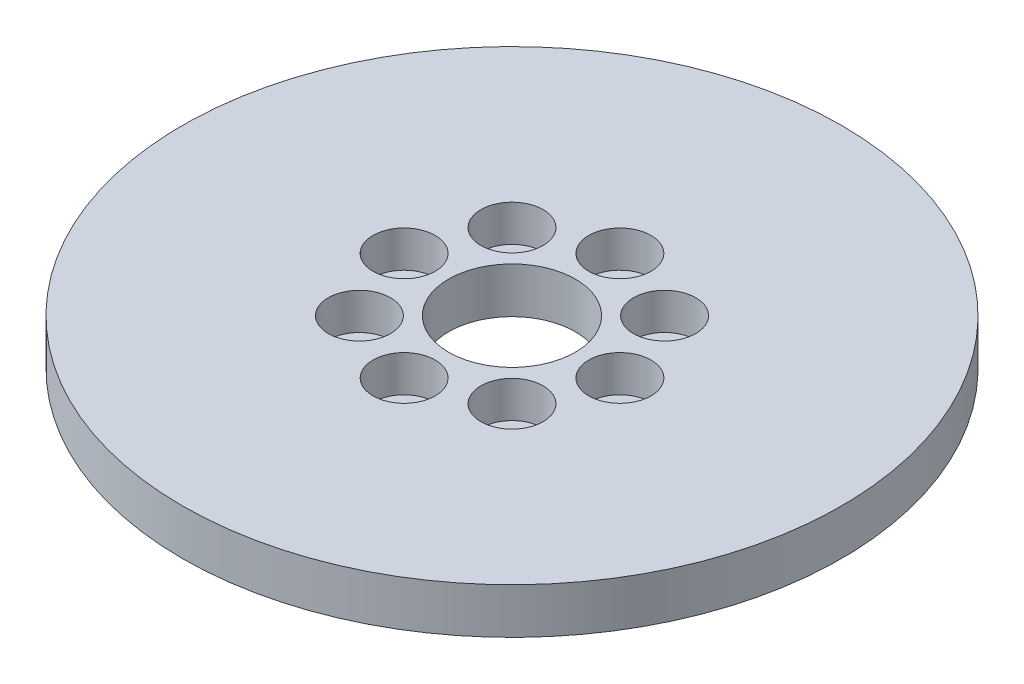
ISO-10303-21;
HEADER;
FILE_DESCRIPTION(('STEP AP214'),'2;1');
FILE_NAME('part.step','',(''),(''),'','','');
FILE_SCHEMA(('AUTOMOTIVE_DESIGN { 1 0 10303 214 1 1 1 1 }'));
ENDSEC;
DATA;
#1=APPLICATION_CONTEXT('core data for automotive mechanical design processes');
#2=APPLICATION_PROTOCOL_DEFINITION('international standard','automotive_design',2000,#1);
#3=PRODUCT_CONTEXT('',#1,'mechanical');
#4=PRODUCT('Part','Part','',(#3));
#5=PRODUCT_RELATED_PRODUCT_CATEGORY('part','',(#4));
#6=PRODUCT_DEFINITION_FORMATION('','',#4);
#7=PRODUCT_DEFINITION_CONTEXT('part definition',#1,'design');
#8=PRODUCT_DEFINITION('design','',#6,#7);
#9=PRODUCT_DEFINITION_SHAPE('','',#8);
#10=(LENGTH_UNIT() NAMED_UNIT(*) SI_UNIT(.MILLI.,.METRE.));
#11=(NAMED_UNIT(*) PLANE_ANGLE_UNIT() SI_UNIT($,.RADIAN.));
#12=(NAMED_UNIT(*) SI_UNIT($,.STERADIAN.) SOLID_ANGLE_UNIT());
#13=UNCERTAINTY_MEASURE_WITH_UNIT(LENGTH_MEASURE(1.E-05),#10,'distance_accuracy_value','');
#14=(GEOMETRIC_REPRESENTATION_CONTEXT(3) GLOBAL_UNCERTAINTY_ASSIGNED_CONTEXT((#13)) GLOBAL_UNIT_ASSIGNED_CONTEXT((#10,
#11,#12)) REPRESENTATION_CONTEXT('',''));
#15=CARTESIAN_POINT('',(0.,0.,0.));
#16=DIRECTION('',(0.,0.,1.));
#17=DIRECTION('',(1.,0.,0.));
#18=AXIS2_PLACEMENT_3D('',#15,#16,#17);
#19=CARTESIAN_POINT('',(0.,9.,0.));
#20=DIRECTION('',(0.,-1.,0.));
#21=DIRECTION('',(0.,0.,-1.));
#22=AXIS2_PLACEMENT_3D('',#19,#20,#21);
#23=CYLINDRICAL_SURFACE('',#22,65.);
#24=CARTESIAN_POINT('',(0.,9.,0.));
#25=DIRECTION('',(0.,1.,0.));
#26=DIRECTION('',(0.,0.,1.));
#27=AXIS2_PLACEMENT_3D('',#24,#25,#26);
#28=CIRCLE('',#27,65.);
#29=CARTESIAN_POINT('',(0.,9.,65.));
#30=VERTEX_POINT('',#29);
#31=EDGE_CURVE('E10',#30,#30,#28,.T.);
#32=ORIENTED_EDGE('',*,*,#31,.F.);
#33=EDGE_LOOP('',(#32));
#34=FACE_BOUND('',#33,.T.);
#35=CARTESIAN_POINT('',(0.,0.,0.));
#36=DIRECTION('',(0.,1.,0.));
#37=DIRECTION('',(0.,0.,1.));
#38=AXIS2_PLACEMENT_3D('',#35,#36,#37);
#39=CIRCLE('',#38,65.);
#40=CARTESIAN_POINT('',(0.,0.,65.));
#41=VERTEX_POINT('',#40);
#42=EDGE_CURVE('E37',#41,#41,#39,.T.);
#43=ORIENTED_EDGE('',*,*,#42,.T.);
#44=EDGE_LOOP('',(#43));
#45=FACE_BOUND('',#44,.T.);
#46=ADVANCED_FACE('F40',(#34,#45),#23,.T.);
#47=CARTESIAN_POINT('',(0.,9.,0.));
#48=DIRECTION('',(0.,1.,0.));
#49=DIRECTION('',(0.,0.,1.));
#50=AXIS2_PLACEMENT_3D('',#47,#48,#49);
#51=PLANE('',#50);
#52=CARTESIAN_POINT('',(0.,9.,21.2800590413485));
#53=DIRECTION('',(0.,1.,0.));
#54=DIRECTION('',(1.,0.,0.));
#55=AXIS2_PLACEMENT_3D('',#52,#53,#54);
#56=CIRCLE('',#55,6.13402978247689);
#57=CARTESIAN_POINT('',(6.13402978247697,9.,21.2800590413485));
#58=VERTEX_POINT('',#57);
#59=EDGE_CURVE('E88',#58,#58,#56,.T.);
#60=ORIENTED_EDGE('',*,*,#59,.F.);
#61=EDGE_LOOP('',(#60));
#62=FACE_BOUND('',#61,.T.);
#63=CARTESIAN_POINT('',(15.0472740521877,9.,15.0472740521875));
#64=DIRECTION('',(0.,1.,0.));
#65=DIRECTION('',(0.707106781186544,0.,-0.707106781186551));
#66=AXIS2_PLACEMENT_3D('',#63,#64,#65);
#67=CIRCLE('',#66,6.13402978247689);
#68=CARTESIAN_POINT('',(19.3846881073773,9.,10.7098599969979));
#69=VERTEX_POINT('',#68);
#70=EDGE_CURVE('E79',#69,#69,#67,.T.);
#71=ORIENTED_EDGE('',*,*,#70,.F.);
#72=EDGE_LOOP('',(#71));
#73=FACE_BOUND('',#72,.T.);
#74=CARTESIAN_POINT('',(21.2800590413485,9.,0.));
#75=DIRECTION('',(0.,1.,0.));
#76=DIRECTION('',(0.,0.,-1.));
#77=AXIS2_PLACEMENT_3D('',#74,#75,#76);
#78=CIRCLE('',#77,6.13402978247689);
#79=CARTESIAN_POINT('',(21.2800590413485,9.,-6.13402978247689));
#80=VERTEX_POINT('',#79);
#81=EDGE_CURVE('E74',#80,#80,#78,.T.);
#82=ORIENTED_EDGE('',*,*,#81,.F.);
#83=EDGE_LOOP('',(#82));
#84=FACE_BOUND('',#83,.T.);
#85=CARTESIAN_POINT('',(15.0472740521875,9.,-15.0472740521878));
#86=DIRECTION('',(0.,1.,0.));
#87=DIRECTION('',(-0.707106781186554,0.,-0.707106781186541));
#88=AXIS2_PLACEMENT_3D('',#85,#86,#87);
#89=CIRCLE('',#88,6.13402978247689);
#90=CARTESIAN_POINT('',(10.7098599969978,9.,-19.3846881073774));
#91=VERTEX_POINT('',#90);
#92=EDGE_CURVE('E70',#91,#91,#89,.T.);
#93=ORIENTED_EDGE('',*,*,#92,.F.);
#94=EDGE_LOOP('',(#93));
#95=FACE_BOUND('',#94,.T.);
#96=CARTESIAN_POINT('',(-2.22896787097045E-13,9.,-21.2800590413485));
#97=DIRECTION('',(0.,1.,0.));
#98=DIRECTION('',(-1.,0.,0.));
#99=AXIS2_PLACEMENT_3D('',#96,#97,#98);
#100=CIRCLE('',#99,6.13402978247689);
#101=CARTESIAN_POINT('',(-6.13402978247712,9.,-21.2800590413484));
#102=VERTEX_POINT('',#101);
#103=EDGE_CURVE('E100',#102,#102,#100,.T.);
#104=ORIENTED_EDGE('',*,*,#103,.F.);
#105=EDGE_LOOP('',(#104));
#106=FACE_BOUND('',#105,.T.);
#107=CARTESIAN_POINT('',(-15.0472740521878,9.,-15.0472740521874));
#108=DIRECTION('',(0.,1.,0.));
#109=DIRECTION('',(-0.707106781186539,0.,0.707106781186556));
#110=AXIS2_PLACEMENT_3D('',#107,#108,#109);
#111=CIRCLE('',#110,6.13402978247689);
#112=CARTESIAN_POINT('',(-19.3846881073774,9.,-10.7098599969977));
#113=VERTEX_POINT('',#112);
#114=EDGE_CURVE('E93',#113,#113,#111,.T.);
#115=ORIENTED_EDGE('',*,*,#114,.F.);
#116=EDGE_LOOP('',(#115));
#117=FACE_BOUND('',#116,.T.);
#118=CARTESIAN_POINT('',(-15.0472740521876,9.,15.0472740521876));
#119=DIRECTION('',(0.,1.,0.));
#120=DIRECTION('',(0.707106781186549,0.,0.707106781186546));
#121=AXIS2_PLACEMENT_3D('',#118,#119,#120);
#122=CIRCLE('',#121,6.13402978247689);
#123=CARTESIAN_POINT('',(-10.7098599969979,9.,19.3846881073773));
#124=VERTEX_POINT('',#123);
#125=EDGE_CURVE('E61',#124,#124,#122,.T.);
#126=ORIENTED_EDGE('',*,*,#125,.F.);
#127=EDGE_LOOP('',(#126));
#128=FACE_BOUND('',#127,.T.);
#129=CARTESIAN_POINT('',(-21.2800590413485,9.,0.));
#130=DIRECTION('',(0.,1.,0.));
#131=DIRECTION('',(0.,0.,1.));
#132=AXIS2_PLACEMENT_3D('',#129,#130,#131);
#133=CIRCLE('',#132,6.13402978247689);
#134=CARTESIAN_POINT('',(-21.2800590413485,9.,6.13402978247689));
#135=VERTEX_POINT('',#134);
#136=EDGE_CURVE('E54',#135,#135,#133,.T.);
#137=ORIENTED_EDGE('',*,*,#136,.F.);
#138=EDGE_LOOP('',(#137));
#139=FACE_BOUND('',#138,.T.);
#140=CARTESIAN_POINT('',(0.,9.,0.));
#141=DIRECTION('',(0.,1.,0.));
#142=DIRECTION('',(0.,0.,1.));
#143=AXIS2_PLACEMENT_3D('',#140,#141,#142);
#144=CIRCLE('',#143,12.5);
#145=CARTESIAN_POINT('',(0.,9.,12.5));
#146=VERTEX_POINT('',#145);
#147=EDGE_CURVE('E50',#146,#146,#144,.T.);
#148=ORIENTED_EDGE('',*,*,#147,.F.);
#149=EDGE_LOOP('',(#148));
#150=FACE_BOUND('',#149,.T.);
#151=ORIENTED_EDGE('',*,*,#31,.T.);
#152=EDGE_LOOP('',(#151));
#153=FACE_BOUND('',#152,.T.);
#154=ADVANCED_FACE('F115',(#62,#73,#84,#95,#106,#117,#128,#139,#150,#153),#51,.T.);
#155=CARTESIAN_POINT('',(0.,0.,0.));
#156=DIRECTION('',(0.,1.,0.));
#157=DIRECTION('',(0.,0.,1.));
#158=AXIS2_PLACEMENT_3D('',#155,#156,#157);
#159=PLANE('',#158);
#160=CARTESIAN_POINT('',(0.,0.,0.));
#161=DIRECTION('',(0.,1.,0.));
#162=DIRECTION('',(0.,0.,1.));
#163=AXIS2_PLACEMENT_3D('',#160,#161,#162);
#164=CIRCLE('',#163,12.5);
#165=CARTESIAN_POINT('',(0.,0.,12.5));
#166=VERTEX_POINT('',#165);
#167=EDGE_CURVE('E47',#166,#166,#164,.T.);
#168=ORIENTED_EDGE('',*,*,#167,.T.);
#169=EDGE_LOOP('',(#168));
#170=FACE_BOUND('',#169,.T.);
#171=ORIENTED_EDGE('',*,*,#42,.F.);
#172=EDGE_LOOP('',(#171));
#173=FACE_BOUND('',#172,.T.);
#174=ADVANCED_FACE('F113',(#170,#173),#159,.F.);
#175=CARTESIAN_POINT('',(0.,9.,0.));
#176=DIRECTION('',(0.,-1.,0.));
#177=DIRECTION('',(0.,0.,-1.));
#178=AXIS2_PLACEMENT_3D('',#175,#176,#177);
#179=CYLINDRICAL_SURFACE('',#178,12.5);
#180=ORIENTED_EDGE('',*,*,#147,.T.);
#181=EDGE_LOOP('',(#180));
#182=FACE_BOUND('',#181,.T.);
#183=ORIENTED_EDGE('',*,*,#167,.F.);
#184=EDGE_LOOP('',(#183));
#185=FACE_BOUND('',#184,.T.);
#186=ADVANCED_FACE('F127',(#182,#185),#179,.F.);
#187=CARTESIAN_POINT('',(-21.2800590413485,1.78640218968353,0.));
#188=DIRECTION('',(0.,1.,0.));
#189=DIRECTION('',(0.,0.,1.));
#190=AXIS2_PLACEMENT_3D('',#187,#188,#189);
#191=CYLINDRICAL_SURFACE('',#190,6.13402978247689);
#192=CARTESIAN_POINT('',(-21.2800590413485,1.78640218968353,0.));
#193=DIRECTION('',(0.,1.,0.));
#194=DIRECTION('',(0.,0.,1.));
#195=AXIS2_PLACEMENT_3D('',#192,#193,#194);
#196=CIRCLE('',#195,6.13402978247689);
#197=CARTESIAN_POINT('',(-21.2800590413485,1.78640218968353,6.13402978247689));
#198=VERTEX_POINT('',#197);
#199=EDGE_CURVE('E55',#198,#198,#196,.T.);
#200=ORIENTED_EDGE('',*,*,#199,.F.);
#201=EDGE_LOOP('',(#200));
#202=FACE_BOUND('',#201,.T.);
#203=ORIENTED_EDGE('',*,*,#136,.T.);
#204=EDGE_LOOP('',(#203));
#205=FACE_BOUND('',#204,.T.);
#206=ADVANCED_FACE('F129',(#202,#205),#191,.F.);
#207=CARTESIAN_POINT('',(-21.2800590413485,1.78640218968353,0.));
#208=DIRECTION('',(0.,1.,0.));
#209=DIRECTION('',(0.,0.,1.));
#210=AXIS2_PLACEMENT_3D('',#207,#208,#209);
#211=PLANE('',#210);
#212=ORIENTED_EDGE('',*,*,#199,.T.);
#213=EDGE_LOOP('',(#212));
#214=FACE_BOUND('',#213,.T.);
#215=ADVANCED_FACE('F157',(#214),#211,.T.);
#216=CARTESIAN_POINT('',(-15.0472740521876,1.78640218968353,15.0472740521876));
#217=DIRECTION('',(0.,1.,0.));
#218=DIRECTION('',(0.,0.,1.));
#219=AXIS2_PLACEMENT_3D('',#216,#217,#218);
#220=CYLINDRICAL_SURFACE('',#219,6.13402978247689);
#221=CARTESIAN_POINT('',(-15.0472740521876,1.78640218968353,15.0472740521876));
#222=DIRECTION('',(0.,1.,0.));
#223=DIRECTION('',(0.707106781186549,0.,0.707106781186546));
#224=AXIS2_PLACEMENT_3D('',#221,#222,#223);
#225=CIRCLE('',#224,6.13402978247689);
#226=CARTESIAN_POINT('',(-10.7098599969979,1.78640218968353,19.3846881073773));
#227=VERTEX_POINT('',#226);
#228=EDGE_CURVE('E59',#227,#227,#225,.T.);
#229=ORIENTED_EDGE('',*,*,#228,.F.);
#230=EDGE_LOOP('',(#229));
#231=FACE_BOUND('',#230,.T.);
#232=ORIENTED_EDGE('',*,*,#125,.T.);
#233=EDGE_LOOP('',(#232));
#234=FACE_BOUND('',#233,.T.);
#235=ADVANCED_FACE('F170',(#231,#234),#220,.F.);
#236=CARTESIAN_POINT('',(-15.0472740521876,1.78640218968353,15.0472740521876));
#237=DIRECTION('',(0.,1.,0.));
#238=DIRECTION('',(0.707106781186549,0.,0.707106781186546));
#239=AXIS2_PLACEMENT_3D('',#236,#237,#238);
#240=PLANE('',#239);
#241=ORIENTED_EDGE('',*,*,#228,.T.);
#242=EDGE_LOOP('',(#241));
#243=FACE_BOUND('',#242,.T.);
#244=ADVANCED_FACE('F182',(#243),#240,.T.);
#245=CARTESIAN_POINT('',(-15.0472740521878,1.78640218968353,-15.0472740521874));
#246=DIRECTION('',(0.,1.,0.));
#247=DIRECTION('',(0.,0.,1.));
#248=AXIS2_PLACEMENT_3D('',#245,#246,#247);
#249=CYLINDRICAL_SURFACE('',#248,6.13402978247689);
#250=CARTESIAN_POINT('',(-15.0472740521878,1.78640218968353,-15.0472740521874));
#251=DIRECTION('',(0.,1.,0.));
#252=DIRECTION('',(-0.707106781186539,0.,0.707106781186556));
#253=AXIS2_PLACEMENT_3D('',#250,#251,#252);
#254=CIRCLE('',#253,6.13402978247689);
#255=CARTESIAN_POINT('',(-19.3846881073774,1.78640218968353,-10.7098599969977));
#256=VERTEX_POINT('',#255);
#257=EDGE_CURVE('E94',#256,#256,#254,.T.);
#258=ORIENTED_EDGE('',*,*,#257,.F.);
#259=EDGE_LOOP('',(#258));
#260=FACE_BOUND('',#259,.T.);
#261=ORIENTED_EDGE('',*,*,#114,.T.);
#262=EDGE_LOOP('',(#261));
#263=FACE_BOUND('',#262,.T.);
#264=ADVANCED_FACE('F189',(#260,#263),#249,.F.);
#265=CARTESIAN_POINT('',(-15.0472740521878,1.78640218968353,-15.0472740521874));
#266=DIRECTION('',(0.,1.,0.));
#267=DIRECTION('',(-0.707106781186539,0.,0.707106781186556));
#268=AXIS2_PLACEMENT_3D('',#265,#266,#267);
#269=PLANE('',#268);
#270=ORIENTED_EDGE('',*,*,#257,.T.);
#271=EDGE_LOOP('',(#270));
#272=FACE_BOUND('',#271,.T.);
#273=ADVANCED_FACE('F107',(#272),#269,.T.);
#274=CARTESIAN_POINT('',(-2.22896787097045E-13,1.78640218968353,-21.2800590413485));
#275=DIRECTION('',(0.,1.,0.));
#276=DIRECTION('',(0.,0.,1.));
#277=AXIS2_PLACEMENT_3D('',#274,#275,#276);
#278=CYLINDRICAL_SURFACE('',#277,6.13402978247689);
#279=CARTESIAN_POINT('',(-2.22896787097045E-13,1.78640218968353,-21.2800590413485));
#280=DIRECTION('',(0.,1.,0.));
#281=DIRECTION('',(-1.,0.,0.));
#282=AXIS2_PLACEMENT_3D('',#279,#280,#281);
#283=CIRCLE('',#282,6.13402978247689);
#284=CARTESIAN_POINT('',(-6.13402978247712,1.78640218968353,-21.2800590413484));
#285=VERTEX_POINT('',#284);
#286=EDGE_CURVE('E72',#285,#285,#283,.T.);
#287=ORIENTED_EDGE('',*,*,#286,.F.);
#288=EDGE_LOOP('',(#287));
#289=FACE_BOUND('',#288,.T.);
#290=ORIENTED_EDGE('',*,*,#103,.T.);
#291=EDGE_LOOP('',(#290));
#292=FACE_BOUND('',#291,.T.);
#293=ADVANCED_FACE('F104',(#289,#292),#278,.F.);
#294=CARTESIAN_POINT('',(-2.22896787097045E-13,1.78640218968353,-21.2800590413485));
#295=DIRECTION('',(0.,1.,0.));
#296=DIRECTION('',(-1.,0.,0.));
#297=AXIS2_PLACEMENT_3D('',#294,#295,#296);
#298=PLANE('',#297);
#299=ORIENTED_EDGE('',*,*,#286,.T.);
#300=EDGE_LOOP('',(#299));
#301=FACE_BOUND('',#300,.T.);
#302=ADVANCED_FACE('F103',(#301),#298,.T.);
#303=CARTESIAN_POINT('',(15.0472740521875,1.78640218968353,-15.0472740521878));
#304=DIRECTION('',(0.,1.,0.));
#305=DIRECTION('',(0.,0.,1.));
#306=AXIS2_PLACEMENT_3D('',#303,#304,#305);
#307=CYLINDRICAL_SURFACE('',#306,6.13402978247689);
#308=CARTESIAN_POINT('',(15.0472740521875,1.78640218968353,-15.0472740521878));
#309=DIRECTION('',(0.,1.,0.));
#310=DIRECTION('',(-0.707106781186554,0.,-0.707106781186541));
#311=AXIS2_PLACEMENT_3D('',#308,#309,#310);
#312=CIRCLE('',#311,6.13402978247689);
#313=CARTESIAN_POINT('',(10.7098599969978,1.78640218968353,-19.3846881073774));
#314=VERTEX_POINT('',#313);
#315=EDGE_CURVE('E69',#314,#314,#312,.T.);
#316=ORIENTED_EDGE('',*,*,#315,.F.);
#317=EDGE_LOOP('',(#316));
#318=FACE_BOUND('',#317,.T.);
#319=ORIENTED_EDGE('',*,*,#92,.T.);
#320=EDGE_LOOP('',(#319));
#321=FACE_BOUND('',#320,.T.);
#322=ADVANCED_FACE('F219',(#318,#321),#307,.F.);
#323=CARTESIAN_POINT('',(15.0472740521875,1.78640218968353,-15.0472740521878));
#324=DIRECTION('',(0.,1.,0.));
#325=DIRECTION('',(-0.707106781186554,0.,-0.707106781186541));
#326=AXIS2_PLACEMENT_3D('',#323,#324,#325);
#327=PLANE('',#326);
#328=ORIENTED_EDGE('',*,*,#315,.T.);
#329=EDGE_LOOP('',(#328));
#330=FACE_BOUND('',#329,.T.);
#331=ADVANCED_FACE('F227',(#330),#327,.T.);
#332=CARTESIAN_POINT('',(21.2800590413485,1.78640218968353,0.));
#333=DIRECTION('',(0.,1.,0.));
#334=DIRECTION('',(0.,0.,1.));
#335=AXIS2_PLACEMENT_3D('',#332,#333,#334);
#336=CYLINDRICAL_SURFACE('',#335,6.13402978247689);
#337=CARTESIAN_POINT('',(21.2800590413485,1.78640218968353,0.));
#338=DIRECTION('',(0.,1.,0.));
#339=DIRECTION('',(0.,0.,-1.));
#340=AXIS2_PLACEMENT_3D('',#337,#338,#339);
#341=CIRCLE('',#340,6.13402978247689);
#342=CARTESIAN_POINT('',(21.2800590413485,1.78640218968353,-6.13402978247689));
#343=VERTEX_POINT('',#342);
#344=EDGE_CURVE('E80',#343,#343,#341,.T.);
#345=ORIENTED_EDGE('',*,*,#344,.F.);
#346=EDGE_LOOP('',(#345));
#347=FACE_BOUND('',#346,.T.);
#348=ORIENTED_EDGE('',*,*,#81,.T.);
#349=EDGE_LOOP('',(#348));
#350=FACE_BOUND('',#349,.T.);
#351=ADVANCED_FACE('F240',(#347,#350),#336,.F.);
#352=CARTESIAN_POINT('',(21.2800590413485,1.78640218968353,0.));
#353=DIRECTION('',(0.,1.,0.));
#354=DIRECTION('',(0.,0.,-1.));
#355=AXIS2_PLACEMENT_3D('',#352,#353,#354);
#356=PLANE('',#355);
#357=ORIENTED_EDGE('',*,*,#344,.T.);
#358=EDGE_LOOP('',(#357));
#359=FACE_BOUND('',#358,.T.);
#360=ADVANCED_FACE('F246',(#359),#356,.T.);
#361=CARTESIAN_POINT('',(15.0472740521877,1.78640218968353,15.0472740521875));
#362=DIRECTION('',(0.,1.,0.));
#363=DIRECTION('',(0.,0.,1.));
#364=AXIS2_PLACEMENT_3D('',#361,#362,#363);
#365=CYLINDRICAL_SURFACE('',#364,6.13402978247689);
#366=CARTESIAN_POINT('',(15.0472740521877,1.78640218968353,15.0472740521875));
#367=DIRECTION('',(0.,1.,0.));
#368=DIRECTION('',(0.707106781186544,0.,-0.707106781186551));
#369=AXIS2_PLACEMENT_3D('',#366,#367,#368);
#370=CIRCLE('',#369,6.13402978247689);
#371=CARTESIAN_POINT('',(19.3846881073773,1.78640218968353,10.7098599969979));
#372=VERTEX_POINT('',#371);
#373=EDGE_CURVE('E82',#372,#372,#370,.T.);
#374=ORIENTED_EDGE('',*,*,#373,.F.);
#375=EDGE_LOOP('',(#374));
#376=FACE_BOUND('',#375,.T.);
#377=ORIENTED_EDGE('',*,*,#70,.T.);
#378=EDGE_LOOP('',(#377));
#379=FACE_BOUND('',#378,.T.);
#380=ADVANCED_FACE('F254',(#376,#379),#365,.F.);
#381=CARTESIAN_POINT('',(15.0472740521877,1.78640218968353,15.0472740521875));
#382=DIRECTION('',(0.,1.,0.));
#383=DIRECTION('',(0.707106781186544,0.,-0.707106781186551));
#384=AXIS2_PLACEMENT_3D('',#381,#382,#383);
#385=PLANE('',#384);
#386=ORIENTED_EDGE('',*,*,#373,.T.);
#387=EDGE_LOOP('',(#386));
#388=FACE_BOUND('',#387,.T.);
#389=ADVANCED_FACE('F262',(#388),#385,.T.);
#390=CARTESIAN_POINT('',(0.,1.78640218968353,21.2800590413485));
#391=DIRECTION('',(0.,1.,0.));
#392=DIRECTION('',(0.,0.,1.));
#393=AXIS2_PLACEMENT_3D('',#390,#391,#392);
#394=CYLINDRICAL_SURFACE('',#393,6.13402978247689);
#395=CARTESIAN_POINT('',(0.,1.78640218968353,21.2800590413485));
#396=DIRECTION('',(0.,1.,0.));
#397=DIRECTION('',(1.,0.,0.));
#398=AXIS2_PLACEMENT_3D('',#395,#396,#397);
#399=CIRCLE('',#398,6.13402978247689);
#400=CARTESIAN_POINT('',(6.13402978247697,1.78640218968353,21.2800590413485));
#401=VERTEX_POINT('',#400);
#402=EDGE_CURVE('E63',#401,#401,#399,.T.);
#403=ORIENTED_EDGE('',*,*,#402,.F.);
#404=EDGE_LOOP('',(#403));
#405=FACE_BOUND('',#404,.T.);
#406=ORIENTED_EDGE('',*,*,#59,.T.);
#407=EDGE_LOOP('',(#406));
#408=FACE_BOUND('',#407,.T.);
#409=ADVANCED_FACE('F272',(#405,#408),#394,.F.);
#410=CARTESIAN_POINT('',(0.,1.78640218968353,21.2800590413485));
#411=DIRECTION('',(0.,1.,0.));
#412=DIRECTION('',(1.,0.,0.));
#413=AXIS2_PLACEMENT_3D('',#410,#411,#412);
#414=PLANE('',#413);
#415=ORIENTED_EDGE('',*,*,#402,.T.);
#416=EDGE_LOOP('',(#415));
#417=FACE_BOUND('',#416,.T.);
#418=ADVANCED_FACE('F285',(#417),#414,.T.);
#419=CLOSED_SHELL('',(#46,#154,#174,#186,#206,#215,#235,#244,#264,#273,#293,#302,#322,#331,#351,
#360,#380,#389,#409,#418));
#420=MANIFOLD_SOLID_BREP('B2',#419);
#421=ADVANCED_BREP_SHAPE_REPRESENTATION('',(#18,#420),#14);
#422=SHAPE_DEFINITION_REPRESENTATION(#9,#421);
ENDSEC;
END-ISO-10303-21;
